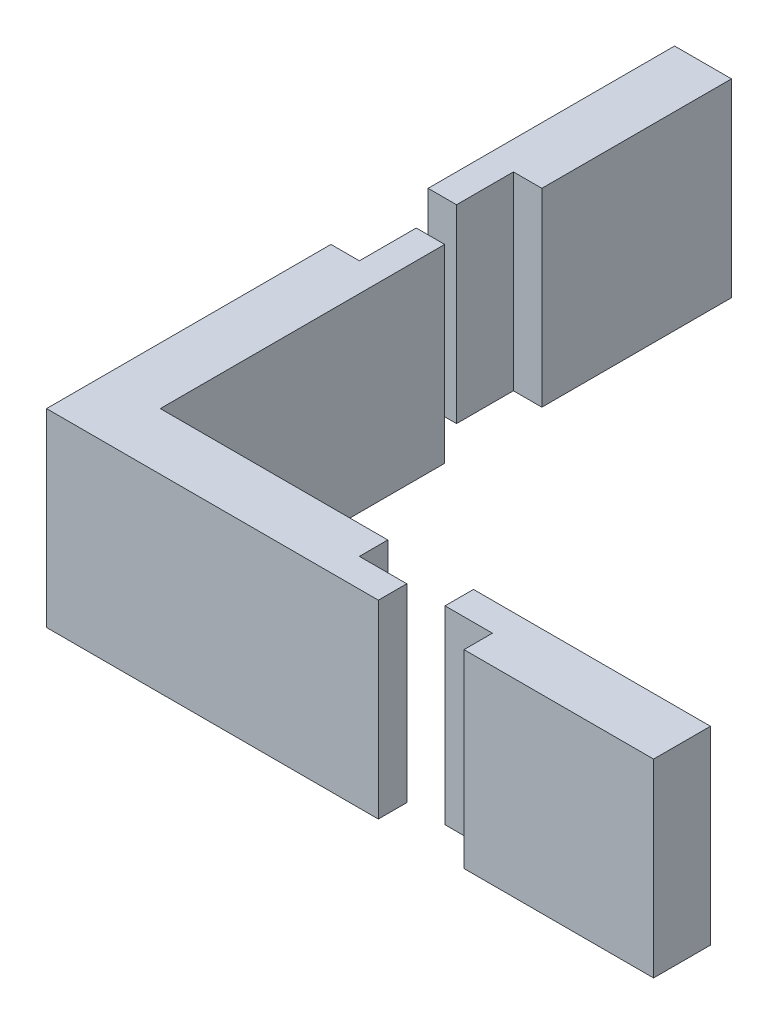
ISO-10303-21;
HEADER;
FILE_DESCRIPTION(('STEP AP214'),'2;1');
FILE_NAME('part.step','',(''),(''),'','','');
FILE_SCHEMA(('AUTOMOTIVE_DESIGN { 1 0 10303 214 1 1 1 1 }'));
ENDSEC;
DATA;
#1=APPLICATION_CONTEXT('core data for automotive mechanical design processes');
#2=APPLICATION_PROTOCOL_DEFINITION('international standard','automotive_design',2000,#1);
#3=PRODUCT_CONTEXT('',#1,'mechanical');
#4=PRODUCT('Part','Part','',(#3));
#5=PRODUCT_RELATED_PRODUCT_CATEGORY('part','',(#4));
#6=PRODUCT_DEFINITION_FORMATION('','',#4);
#7=PRODUCT_DEFINITION_CONTEXT('part definition',#1,'design');
#8=PRODUCT_DEFINITION('design','',#6,#7);
#9=PRODUCT_DEFINITION_SHAPE('','',#8);
#10=(LENGTH_UNIT() NAMED_UNIT(*) SI_UNIT(.MILLI.,.METRE.));
#11=(NAMED_UNIT(*) PLANE_ANGLE_UNIT() SI_UNIT($,.RADIAN.));
#12=(NAMED_UNIT(*) SI_UNIT($,.STERADIAN.) SOLID_ANGLE_UNIT());
#13=UNCERTAINTY_MEASURE_WITH_UNIT(LENGTH_MEASURE(1.E-05),#10,'distance_accuracy_value','');
#14=(GEOMETRIC_REPRESENTATION_CONTEXT(3) GLOBAL_UNCERTAINTY_ASSIGNED_CONTEXT((#13)) GLOBAL_UNIT_ASSIGNED_CONTEXT((#10,
#11,#12)) REPRESENTATION_CONTEXT('',''));
#15=CARTESIAN_POINT('',(0.,0.,0.));
#16=DIRECTION('',(0.,0.,1.));
#17=DIRECTION('',(1.,0.,0.));
#18=AXIS2_PLACEMENT_3D('',#15,#16,#17);
#19=CARTESIAN_POINT('',(0.,10.,-10.5));
#20=DIRECTION('',(0.,0.,1.));
#21=DIRECTION('',(1.,0.,0.));
#22=AXIS2_PLACEMENT_3D('',#19,#20,#21);
#23=PLANE('',#22);
#24=DIRECTION('',(-1.,0.,0.));
#25=VECTOR('',#24,1.);
#26=CARTESIAN_POINT('',(0.,0.,-10.5));
#27=LINE('',#26,#25);
#28=CARTESIAN_POINT('',(1.5,0.,-10.5));
#29=VERTEX_POINT('',#28);
#30=CARTESIAN_POINT('',(0.,0.,-10.5));
#31=VERTEX_POINT('',#30);
#32=EDGE_CURVE('E186',#29,#31,#27,.T.);
#33=ORIENTED_EDGE('',*,*,#32,.T.);
#34=DIRECTION('',(0.,-1.,0.));
#35=VECTOR('',#34,1.);
#36=CARTESIAN_POINT('',(0.,10.,-10.5));
#37=LINE('',#36,#35);
#38=CARTESIAN_POINT('',(0.,10.,-10.5));
#39=VERTEX_POINT('',#38);
#40=EDGE_CURVE('E205',#39,#31,#37,.T.);
#41=ORIENTED_EDGE('',*,*,#40,.F.);
#42=DIRECTION('',(-1.,0.,0.));
#43=VECTOR('',#42,1.);
#44=CARTESIAN_POINT('',(0.,10.,-10.5));
#45=LINE('',#44,#43);
#46=CARTESIAN_POINT('',(1.5,10.,-10.5));
#47=VERTEX_POINT('',#46);
#48=EDGE_CURVE('E183',#47,#39,#45,.T.);
#49=ORIENTED_EDGE('',*,*,#48,.F.);
#50=DIRECTION('',(0.,-1.,0.));
#51=VECTOR('',#50,1.);
#52=CARTESIAN_POINT('',(1.5,10.,-10.5));
#53=LINE('',#52,#51);
#54=EDGE_CURVE('E231',#47,#29,#53,.T.);
#55=ORIENTED_EDGE('',*,*,#54,.T.);
#56=EDGE_LOOP('',(#33,#41,#49,#55));
#57=FACE_BOUND('',#56,.T.);
#58=ADVANCED_FACE('F88',(#57),#23,.F.);
#59=CARTESIAN_POINT('',(1.5,10.,0.));
#60=DIRECTION('',(-1.,0.,0.));
#61=DIRECTION('',(0.,0.,1.));
#62=AXIS2_PLACEMENT_3D('',#59,#60,#61);
#63=PLANE('',#62);
#64=DIRECTION('',(0.,0.,-1.));
#65=VECTOR('',#64,1.);
#66=CARTESIAN_POINT('',(1.5,0.,0.));
#67=LINE('',#66,#65);
#68=CARTESIAN_POINT('',(1.5,0.,4.5));
#69=VERTEX_POINT('',#68);
#70=EDGE_CURVE('E223',#69,#29,#67,.T.);
#71=ORIENTED_EDGE('',*,*,#70,.T.);
#72=ORIENTED_EDGE('',*,*,#54,.F.);
#73=DIRECTION('',(0.,0.,-1.));
#74=VECTOR('',#73,1.);
#75=CARTESIAN_POINT('',(1.5,10.,0.));
#76=LINE('',#75,#74);
#77=CARTESIAN_POINT('',(1.5,10.,4.5));
#78=VERTEX_POINT('',#77);
#79=EDGE_CURVE('E200',#78,#47,#76,.T.);
#80=ORIENTED_EDGE('',*,*,#79,.F.);
#81=DIRECTION('',(0.,-1.,0.));
#82=VECTOR('',#81,1.);
#83=CARTESIAN_POINT('',(1.5,10.,4.5));
#84=LINE('',#83,#82);
#85=EDGE_CURVE('E235',#78,#69,#84,.T.);
#86=ORIENTED_EDGE('',*,*,#85,.T.);
#87=EDGE_LOOP('',(#71,#72,#80,#86));
#88=FACE_BOUND('',#87,.T.);
#89=ADVANCED_FACE('F298',(#88),#63,.F.);
#90=CARTESIAN_POINT('',(0.,10.,-7.5));
#91=DIRECTION('',(0.,0.,-1.));
#92=DIRECTION('',(-1.,0.,0.));
#93=AXIS2_PLACEMENT_3D('',#90,#91,#92);
#94=PLANE('',#93);
#95=DIRECTION('',(1.,0.,0.));
#96=VECTOR('',#95,1.);
#97=CARTESIAN_POINT('',(0.,0.,-7.5));
#98=LINE('',#97,#96);
#99=CARTESIAN_POINT('',(-1.5,0.,-7.5));
#100=VERTEX_POINT('',#99);
#101=CARTESIAN_POINT('',(0.,0.,-7.5));
#102=VERTEX_POINT('',#101);
#103=EDGE_CURVE('E209',#100,#102,#98,.T.);
#104=ORIENTED_EDGE('',*,*,#103,.F.);
#105=DIRECTION('',(0.,-1.,0.));
#106=VECTOR('',#105,1.);
#107=CARTESIAN_POINT('',(-1.5,10.,-7.5));
#108=LINE('',#107,#106);
#109=CARTESIAN_POINT('',(-1.5,10.,-7.5));
#110=VERTEX_POINT('',#109);
#111=EDGE_CURVE('E163',#110,#100,#108,.T.);
#112=ORIENTED_EDGE('',*,*,#111,.F.);
#113=DIRECTION('',(1.,0.,0.));
#114=VECTOR('',#113,1.);
#115=CARTESIAN_POINT('',(0.,10.,-7.5));
#116=LINE('',#115,#114);
#117=CARTESIAN_POINT('',(0.,10.,-7.5));
#118=VERTEX_POINT('',#117);
#119=EDGE_CURVE('E181',#110,#118,#116,.T.);
#120=ORIENTED_EDGE('',*,*,#119,.T.);
#121=DIRECTION('',(0.,-1.,0.));
#122=VECTOR('',#121,1.);
#123=CARTESIAN_POINT('',(0.,10.,-7.5));
#124=LINE('',#123,#122);
#125=EDGE_CURVE('E169',#118,#102,#124,.T.);
#126=ORIENTED_EDGE('',*,*,#125,.T.);
#127=EDGE_LOOP('',(#104,#112,#120,#126));
#128=FACE_BOUND('',#127,.T.);
#129=ADVANCED_FACE('F187',(#128),#94,.T.);
#130=CARTESIAN_POINT('',(0.,10.,0.));
#131=DIRECTION('',(-1.,0.,0.));
#132=DIRECTION('',(0.,0.,1.));
#133=AXIS2_PLACEMENT_3D('',#130,#131,#132);
#134=PLANE('',#133);
#135=DIRECTION('',(0.,0.,-1.));
#136=VECTOR('',#135,1.);
#137=CARTESIAN_POINT('',(0.,0.,0.));
#138=LINE('',#137,#136);
#139=EDGE_CURVE('E173',#102,#31,#138,.T.);
#140=ORIENTED_EDGE('',*,*,#139,.F.);
#141=ORIENTED_EDGE('',*,*,#125,.F.);
#142=DIRECTION('',(0.,0.,-1.));
#143=VECTOR('',#142,1.);
#144=CARTESIAN_POINT('',(0.,10.,0.));
#145=LINE('',#144,#143);
#146=EDGE_CURVE('E92',#118,#39,#145,.T.);
#147=ORIENTED_EDGE('',*,*,#146,.T.);
#148=ORIENTED_EDGE('',*,*,#40,.T.);
#149=EDGE_LOOP('',(#140,#141,#147,#148));
#150=FACE_BOUND('',#149,.T.);
#151=ADVANCED_FACE('F171',(#150),#134,.T.);
#152=CARTESIAN_POINT('',(-1.5,10.,0.));
#153=DIRECTION('',(1.,0.,0.));
#154=DIRECTION('',(0.,0.,-1.));
#155=AXIS2_PLACEMENT_3D('',#152,#153,#154);
#156=PLANE('',#155);
#157=DIRECTION('',(0.,0.,1.));
#158=VECTOR('',#157,1.);
#159=CARTESIAN_POINT('',(-1.5,0.,0.));
#160=LINE('',#159,#158);
#161=CARTESIAN_POINT('',(-1.5,0.,7.5));
#162=VERTEX_POINT('',#161);
#163=EDGE_CURVE('E212',#100,#162,#160,.T.);
#164=ORIENTED_EDGE('',*,*,#163,.T.);
#165=DIRECTION('',(0.,-1.,0.));
#166=VECTOR('',#165,1.);
#167=CARTESIAN_POINT('',(-1.5,10.,7.5));
#168=LINE('',#167,#166);
#169=CARTESIAN_POINT('',(-1.5,10.,7.5));
#170=VERTEX_POINT('',#169);
#171=EDGE_CURVE('E242',#170,#162,#168,.T.);
#172=ORIENTED_EDGE('',*,*,#171,.F.);
#173=DIRECTION('',(0.,0.,1.));
#174=VECTOR('',#173,1.);
#175=CARTESIAN_POINT('',(-1.5,10.,0.));
#176=LINE('',#175,#174);
#177=EDGE_CURVE('E189',#110,#170,#176,.T.);
#178=ORIENTED_EDGE('',*,*,#177,.F.);
#179=ORIENTED_EDGE('',*,*,#111,.T.);
#180=EDGE_LOOP('',(#164,#172,#178,#179));
#181=FACE_BOUND('',#180,.T.);
#182=ADVANCED_FACE('F280',(#181),#156,.F.);
#183=CARTESIAN_POINT('',(0.,10.,4.5));
#184=DIRECTION('',(0.,0.,-1.));
#185=DIRECTION('',(-1.,0.,0.));
#186=AXIS2_PLACEMENT_3D('',#183,#184,#185);
#187=PLANE('',#186);
#188=DIRECTION('',(1.,0.,0.));
#189=VECTOR('',#188,1.);
#190=CARTESIAN_POINT('',(0.,0.,4.5));
#191=LINE('',#190,#189);
#192=CARTESIAN_POINT('',(13.5,0.,4.5));
#193=VERTEX_POINT('',#192);
#194=EDGE_CURVE('E219',#69,#193,#191,.T.);
#195=ORIENTED_EDGE('',*,*,#194,.F.);
#196=ORIENTED_EDGE('',*,*,#85,.F.);
#197=DIRECTION('',(1.,0.,0.));
#198=VECTOR('',#197,1.);
#199=CARTESIAN_POINT('',(0.,10.,4.5));
#200=LINE('',#199,#198);
#201=CARTESIAN_POINT('',(13.5,10.,4.5));
#202=VERTEX_POINT('',#201);
#203=EDGE_CURVE('E196',#78,#202,#200,.T.);
#204=ORIENTED_EDGE('',*,*,#203,.T.);
#205=DIRECTION('',(0.,-1.,0.));
#206=VECTOR('',#205,1.);
#207=CARTESIAN_POINT('',(13.5,10.,4.5));
#208=LINE('',#207,#206);
#209=EDGE_CURVE('E238',#202,#193,#208,.T.);
#210=ORIENTED_EDGE('',*,*,#209,.T.);
#211=EDGE_LOOP('',(#195,#196,#204,#210));
#212=FACE_BOUND('',#211,.T.);
#213=ADVANCED_FACE('F295',(#212),#187,.T.);
#214=CARTESIAN_POINT('',(0.,0.,0.));
#215=DIRECTION('',(0.,1.,0.));
#216=DIRECTION('',(0.,0.,1.));
#217=AXIS2_PLACEMENT_3D('',#214,#215,#216);
#218=PLANE('',#217);
#219=ORIENTED_EDGE('',*,*,#139,.T.);
#220=ORIENTED_EDGE('',*,*,#32,.F.);
#221=ORIENTED_EDGE('',*,*,#70,.F.);
#222=ORIENTED_EDGE('',*,*,#194,.T.);
#223=DIRECTION('',(0.,0.,-1.));
#224=VECTOR('',#223,1.);
#225=CARTESIAN_POINT('',(13.5,0.,0.));
#226=LINE('',#225,#224);
#227=CARTESIAN_POINT('',(13.5,0.,5.99999999999999));
#228=VERTEX_POINT('',#227);
#229=EDGE_CURVE('E216',#228,#193,#226,.T.);
#230=ORIENTED_EDGE('',*,*,#229,.F.);
#231=DIRECTION('',(1.,0.,0.));
#232=VECTOR('',#231,1.);
#233=CARTESIAN_POINT('',(13.5,0.,5.99999999999999));
#234=LINE('',#233,#232);
#235=CARTESIAN_POINT('',(16.,0.,5.99999999999999));
#236=VERTEX_POINT('',#235);
#237=EDGE_CURVE('E252',#228,#236,#234,.T.);
#238=ORIENTED_EDGE('',*,*,#237,.T.);
#239=DIRECTION('',(0.,0.,-1.));
#240=VECTOR('',#239,1.);
#241=CARTESIAN_POINT('',(16.,0.,7.5));
#242=LINE('',#241,#240);
#243=CARTESIAN_POINT('',(16.,0.,7.5));
#244=VERTEX_POINT('',#243);
#245=EDGE_CURVE('E99',#244,#236,#242,.T.);
#246=ORIENTED_EDGE('',*,*,#245,.F.);
#247=DIRECTION('',(1.,0.,0.));
#248=VECTOR('',#247,1.);
#249=CARTESIAN_POINT('',(13.5,0.,7.5));
#250=LINE('',#249,#248);
#251=EDGE_CURVE('E13',#162,#244,#250,.T.);
#252=ORIENTED_EDGE('',*,*,#251,.F.);
#253=ORIENTED_EDGE('',*,*,#163,.F.);
#254=ORIENTED_EDGE('',*,*,#103,.T.);
#255=EDGE_LOOP('',(#219,#220,#221,#222,#230,#238,#246,#252,#253,#254));
#256=FACE_BOUND('',#255,.T.);
#257=ADVANCED_FACE('F278',(#256),#218,.F.);
#258=CARTESIAN_POINT('',(0.,10.,0.));
#259=DIRECTION('',(0.,1.,0.));
#260=DIRECTION('',(0.,0.,1.));
#261=AXIS2_PLACEMENT_3D('',#258,#259,#260);
#262=PLANE('',#261);
#263=ORIENTED_EDGE('',*,*,#146,.F.);
#264=ORIENTED_EDGE('',*,*,#119,.F.);
#265=ORIENTED_EDGE('',*,*,#177,.T.);
#266=DIRECTION('',(1.,0.,0.));
#267=VECTOR('',#266,1.);
#268=CARTESIAN_POINT('',(13.5,10.,7.5));
#269=LINE('',#268,#267);
#270=CARTESIAN_POINT('',(16.,10.,7.5));
#271=VERTEX_POINT('',#270);
#272=EDGE_CURVE('E248',#170,#271,#269,.T.);
#273=ORIENTED_EDGE('',*,*,#272,.T.);
#274=DIRECTION('',(0.,0.,-1.));
#275=VECTOR('',#274,1.);
#276=CARTESIAN_POINT('',(16.,10.,7.5));
#277=LINE('',#276,#275);
#278=CARTESIAN_POINT('',(16.,10.,5.99999999999999));
#279=VERTEX_POINT('',#278);
#280=EDGE_CURVE('E253',#271,#279,#277,.T.);
#281=ORIENTED_EDGE('',*,*,#280,.T.);
#282=DIRECTION('',(1.,0.,0.));
#283=VECTOR('',#282,1.);
#284=CARTESIAN_POINT('',(13.5,10.,5.99999999999999));
#285=LINE('',#284,#283);
#286=CARTESIAN_POINT('',(13.5,10.,5.99999999999999));
#287=VERTEX_POINT('',#286);
#288=EDGE_CURVE('E256',#287,#279,#285,.T.);
#289=ORIENTED_EDGE('',*,*,#288,.F.);
#290=DIRECTION('',(0.,0.,-1.));
#291=VECTOR('',#290,1.);
#292=CARTESIAN_POINT('',(13.5,10.,0.));
#293=LINE('',#292,#291);
#294=EDGE_CURVE('E191',#287,#202,#293,.T.);
#295=ORIENTED_EDGE('',*,*,#294,.T.);
#296=ORIENTED_EDGE('',*,*,#203,.F.);
#297=ORIENTED_EDGE('',*,*,#79,.T.);
#298=ORIENTED_EDGE('',*,*,#48,.T.);
#299=EDGE_LOOP('',(#263,#264,#265,#273,#281,#289,#295,#296,#297,#298));
#300=FACE_BOUND('',#299,.T.);
#301=ADVANCED_FACE('F90',(#300),#262,.T.);
#302=CARTESIAN_POINT('',(13.5,10.,0.));
#303=DIRECTION('',(-1.,0.,0.));
#304=DIRECTION('',(0.,0.,1.));
#305=AXIS2_PLACEMENT_3D('',#302,#303,#304);
#306=PLANE('',#305);
#307=ORIENTED_EDGE('',*,*,#294,.F.);
#308=DIRECTION('',(0.,-1.,0.));
#309=VECTOR('',#308,1.);
#310=CARTESIAN_POINT('',(13.5,10.,5.99999999999999));
#311=LINE('',#310,#309);
#312=EDGE_CURVE('E176',#287,#228,#311,.T.);
#313=ORIENTED_EDGE('',*,*,#312,.T.);
#314=ORIENTED_EDGE('',*,*,#229,.T.);
#315=ORIENTED_EDGE('',*,*,#209,.F.);
#316=EDGE_LOOP('',(#307,#313,#314,#315));
#317=FACE_BOUND('',#316,.T.);
#318=ADVANCED_FACE('F288',(#317),#306,.F.);
#319=CARTESIAN_POINT('',(0.,10.,7.5));
#320=DIRECTION('',(0.,0.,-1.));
#321=DIRECTION('',(-1.,0.,0.));
#322=AXIS2_PLACEMENT_3D('',#319,#320,#321);
#323=PLANE('',#322);
#324=ORIENTED_EDGE('',*,*,#171,.T.);
#325=ORIENTED_EDGE('',*,*,#251,.T.);
#326=DIRECTION('',(0.,-1.,0.));
#327=VECTOR('',#326,1.);
#328=CARTESIAN_POINT('',(16.,10.,7.5));
#329=LINE('',#328,#327);
#330=EDGE_CURVE('E208',#271,#244,#329,.T.);
#331=ORIENTED_EDGE('',*,*,#330,.F.);
#332=ORIENTED_EDGE('',*,*,#272,.F.);
#333=EDGE_LOOP('',(#324,#325,#331,#332));
#334=FACE_BOUND('',#333,.T.);
#335=ADVANCED_FACE('F275',(#334),#323,.F.);
#336=CARTESIAN_POINT('',(16.,10.,7.5));
#337=DIRECTION('',(-1.,0.,0.));
#338=DIRECTION('',(0.,0.,1.));
#339=AXIS2_PLACEMENT_3D('',#336,#337,#338);
#340=PLANE('',#339);
#341=ORIENTED_EDGE('',*,*,#245,.T.);
#342=DIRECTION('',(0.,-1.,0.));
#343=VECTOR('',#342,1.);
#344=CARTESIAN_POINT('',(16.,10.,5.99999999999999));
#345=LINE('',#344,#343);
#346=EDGE_CURVE('E259',#279,#236,#345,.T.);
#347=ORIENTED_EDGE('',*,*,#346,.F.);
#348=ORIENTED_EDGE('',*,*,#280,.F.);
#349=ORIENTED_EDGE('',*,*,#330,.T.);
#350=EDGE_LOOP('',(#341,#347,#348,#349));
#351=FACE_BOUND('',#350,.T.);
#352=ADVANCED_FACE('F272',(#351),#340,.F.);
#353=CARTESIAN_POINT('',(13.5,10.,5.99999999999999));
#354=DIRECTION('',(0.,0.,-1.));
#355=DIRECTION('',(-1.,0.,0.));
#356=AXIS2_PLACEMENT_3D('',#353,#354,#355);
#357=PLANE('',#356);
#358=ORIENTED_EDGE('',*,*,#237,.F.);
#359=ORIENTED_EDGE('',*,*,#312,.F.);
#360=ORIENTED_EDGE('',*,*,#288,.T.);
#361=ORIENTED_EDGE('',*,*,#346,.T.);
#362=EDGE_LOOP('',(#358,#359,#360,#361));
#363=FACE_BOUND('',#362,.T.);
#364=ADVANCED_FACE('F285',(#363),#357,.T.);
#365=CLOSED_SHELL('',(#58,#89,#129,#151,#182,#213,#257,#301,#318,#335,#352,#364));
#366=MANIFOLD_SOLID_BREP('B2',#365);
#367=CARTESIAN_POINT('',(18.0177509488998,10.,0.));
#368=DIRECTION('',(-1.,0.,0.));
#369=DIRECTION('',(0.,0.,1.));
#370=AXIS2_PLACEMENT_3D('',#367,#368,#369);
#371=PLANE('',#370);
#372=DIRECTION('',(0.,0.,-1.));
#373=VECTOR('',#372,1.);
#374=CARTESIAN_POINT('',(18.0177509488998,0.,0.));
#375=LINE('',#374,#373);
#376=CARTESIAN_POINT('',(18.0177509488998,0.,5.99999999999999));
#377=VERTEX_POINT('',#376);
#378=CARTESIAN_POINT('',(18.0177509488998,0.,4.5));
#379=VERTEX_POINT('',#378);
#380=EDGE_CURVE('E86',#377,#379,#375,.T.);
#381=ORIENTED_EDGE('',*,*,#380,.F.);
#382=DIRECTION('',(0.,-1.,0.));
#383=VECTOR('',#382,1.);
#384=CARTESIAN_POINT('',(18.0177509488998,10.,5.99999999999999));
#385=LINE('',#384,#383);
#386=CARTESIAN_POINT('',(18.0177509488998,10.,5.99999999999999));
#387=VERTEX_POINT('',#386);
#388=EDGE_CURVE('E456',#387,#377,#385,.T.);
#389=ORIENTED_EDGE('',*,*,#388,.F.);
#390=DIRECTION('',(0.,0.,-1.));
#391=VECTOR('',#390,1.);
#392=CARTESIAN_POINT('',(18.0177509488998,10.,0.));
#393=LINE('',#392,#391);
#394=CARTESIAN_POINT('',(18.0177509488998,10.,4.5));
#395=VERTEX_POINT('',#394);
#396=EDGE_CURVE('E441',#387,#395,#393,.T.);
#397=ORIENTED_EDGE('',*,*,#396,.T.);
#398=DIRECTION('',(0.,-1.,0.));
#399=VECTOR('',#398,1.);
#400=CARTESIAN_POINT('',(18.0177509488998,10.,4.5));
#401=LINE('',#400,#399);
#402=EDGE_CURVE('E486',#395,#379,#401,.T.);
#403=ORIENTED_EDGE('',*,*,#402,.T.);
#404=EDGE_LOOP('',(#381,#389,#397,#403));
#405=FACE_BOUND('',#404,.T.);
#406=ADVANCED_FACE('F437',(#405),#371,.T.);
#407=CARTESIAN_POINT('',(0.,10.,5.99999999999999));
#408=DIRECTION('',(0.,0.,1.));
#409=DIRECTION('',(1.,0.,0.));
#410=AXIS2_PLACEMENT_3D('',#407,#408,#409);
#411=PLANE('',#410);
#412=DIRECTION('',(-1.,0.,0.));
#413=VECTOR('',#412,1.);
#414=CARTESIAN_POINT('',(0.,0.,5.99999999999999));
#415=LINE('',#414,#413);
#416=CARTESIAN_POINT('',(20.5177509488998,0.,5.99999999999999));
#417=VERTEX_POINT('',#416);
#418=EDGE_CURVE('E447',#417,#377,#415,.T.);
#419=ORIENTED_EDGE('',*,*,#418,.F.);
#420=DIRECTION('',(0.,-1.,0.));
#421=VECTOR('',#420,1.);
#422=CARTESIAN_POINT('',(20.5177509488998,10.,5.99999999999999));
#423=LINE('',#422,#421);
#424=CARTESIAN_POINT('',(20.5177509488998,10.,5.99999999999999));
#425=VERTEX_POINT('',#424);
#426=EDGE_CURVE('E476',#425,#417,#423,.T.);
#427=ORIENTED_EDGE('',*,*,#426,.F.);
#428=DIRECTION('',(-1.,0.,0.));
#429=VECTOR('',#428,1.);
#430=CARTESIAN_POINT('',(0.,10.,5.99999999999999));
#431=LINE('',#430,#429);
#432=EDGE_CURVE('E531',#425,#387,#431,.T.);
#433=ORIENTED_EDGE('',*,*,#432,.T.);
#434=ORIENTED_EDGE('',*,*,#388,.T.);
#435=EDGE_LOOP('',(#419,#427,#433,#434));
#436=FACE_BOUND('',#435,.T.);
#437=ADVANCED_FACE('F555',(#436),#411,.T.);
#438=CARTESIAN_POINT('',(20.5177509488998,10.,0.));
#439=DIRECTION('',(-1.,0.,0.));
#440=DIRECTION('',(0.,0.,1.));
#441=AXIS2_PLACEMENT_3D('',#438,#439,#440);
#442=PLANE('',#441);
#443=DIRECTION('',(0.,0.,-1.));
#444=VECTOR('',#443,1.);
#445=CARTESIAN_POINT('',(20.5177509488998,0.,0.));
#446=LINE('',#445,#444);
#447=CARTESIAN_POINT('',(20.5177509488998,0.,7.5));
#448=VERTEX_POINT('',#447);
#449=EDGE_CURVE('E514',#448,#417,#446,.T.);
#450=ORIENTED_EDGE('',*,*,#449,.F.);
#451=DIRECTION('',(0.,-1.,0.));
#452=VECTOR('',#451,1.);
#453=CARTESIAN_POINT('',(20.5177509488998,10.,7.5));
#454=LINE('',#453,#452);
#455=CARTESIAN_POINT('',(20.5177509488998,10.,7.5));
#456=VERTEX_POINT('',#455);
#457=EDGE_CURVE('E497',#456,#448,#454,.T.);
#458=ORIENTED_EDGE('',*,*,#457,.F.);
#459=DIRECTION('',(0.,0.,-1.));
#460=VECTOR('',#459,1.);
#461=CARTESIAN_POINT('',(20.5177509488998,10.,0.));
#462=LINE('',#461,#460);
#463=EDGE_CURVE('E530',#456,#425,#462,.T.);
#464=ORIENTED_EDGE('',*,*,#463,.T.);
#465=ORIENTED_EDGE('',*,*,#426,.T.);
#466=EDGE_LOOP('',(#450,#458,#464,#465));
#467=FACE_BOUND('',#466,.T.);
#468=ADVANCED_FACE('F519',(#467),#442,.T.);
#469=CARTESIAN_POINT('',(0.,10.,7.49999999999999));
#470=DIRECTION('',(0.,0.,-1.));
#471=DIRECTION('',(-1.,0.,0.));
#472=AXIS2_PLACEMENT_3D('',#469,#470,#471);
#473=PLANE('',#472);
#474=DIRECTION('',(1.,0.,0.));
#475=VECTOR('',#474,1.);
#476=CARTESIAN_POINT('',(0.,0.,7.49999999999999));
#477=LINE('',#476,#475);
#478=CARTESIAN_POINT('',(30.5177509488998,0.,7.5));
#479=VERTEX_POINT('',#478);
#480=EDGE_CURVE('E501',#448,#479,#477,.T.);
#481=ORIENTED_EDGE('',*,*,#480,.T.);
#482=DIRECTION('',(0.,-1.,0.));
#483=VECTOR('',#482,1.);
#484=CARTESIAN_POINT('',(30.5177509488998,10.,7.5));
#485=LINE('',#484,#483);
#486=CARTESIAN_POINT('',(30.5177509488998,10.,7.5));
#487=VERTEX_POINT('',#486);
#488=EDGE_CURVE('E508',#487,#479,#485,.T.);
#489=ORIENTED_EDGE('',*,*,#488,.F.);
#490=DIRECTION('',(1.,0.,0.));
#491=VECTOR('',#490,1.);
#492=CARTESIAN_POINT('',(0.,10.,7.49999999999999));
#493=LINE('',#492,#491);
#494=EDGE_CURVE('E503',#456,#487,#493,.T.);
#495=ORIENTED_EDGE('',*,*,#494,.F.);
#496=ORIENTED_EDGE('',*,*,#457,.T.);
#497=EDGE_LOOP('',(#481,#489,#495,#496));
#498=FACE_BOUND('',#497,.T.);
#499=ADVANCED_FACE('F499',(#498),#473,.F.);
#500=CARTESIAN_POINT('',(30.5177509488998,10.,0.));
#501=DIRECTION('',(1.,0.,0.));
#502=DIRECTION('',(0.,0.,-1.));
#503=AXIS2_PLACEMENT_3D('',#500,#501,#502);
#504=PLANE('',#503);
#505=DIRECTION('',(0.,0.,1.));
#506=VECTOR('',#505,1.);
#507=CARTESIAN_POINT('',(30.5177509488998,0.,0.));
#508=LINE('',#507,#506);
#509=CARTESIAN_POINT('',(30.5177509488998,0.,4.5));
#510=VERTEX_POINT('',#509);
#511=EDGE_CURVE('E517',#510,#479,#508,.T.);
#512=ORIENTED_EDGE('',*,*,#511,.F.);
#513=DIRECTION('',(0.,-1.,0.));
#514=VECTOR('',#513,1.);
#515=CARTESIAN_POINT('',(30.5177509488998,10.,4.5));
#516=LINE('',#515,#514);
#517=CARTESIAN_POINT('',(30.5177509488998,10.,4.5));
#518=VERTEX_POINT('',#517);
#519=EDGE_CURVE('E537',#518,#510,#516,.T.);
#520=ORIENTED_EDGE('',*,*,#519,.F.);
#521=DIRECTION('',(0.,0.,1.));
#522=VECTOR('',#521,1.);
#523=CARTESIAN_POINT('',(30.5177509488998,10.,0.));
#524=LINE('',#523,#522);
#525=EDGE_CURVE('E526',#518,#487,#524,.T.);
#526=ORIENTED_EDGE('',*,*,#525,.T.);
#527=ORIENTED_EDGE('',*,*,#488,.T.);
#528=EDGE_LOOP('',(#512,#520,#526,#527));
#529=FACE_BOUND('',#528,.T.);
#530=ADVANCED_FACE('F542',(#529),#504,.T.);
#531=CARTESIAN_POINT('',(0.,10.,4.5));
#532=DIRECTION('',(0.,0.,1.));
#533=DIRECTION('',(1.,0.,0.));
#534=AXIS2_PLACEMENT_3D('',#531,#532,#533);
#535=PLANE('',#534);
#536=DIRECTION('',(-1.,0.,0.));
#537=VECTOR('',#536,1.);
#538=CARTESIAN_POINT('',(0.,0.,4.5));
#539=LINE('',#538,#537);
#540=EDGE_CURVE('E532',#510,#379,#539,.T.);
#541=ORIENTED_EDGE('',*,*,#540,.T.);
#542=ORIENTED_EDGE('',*,*,#402,.F.);
#543=DIRECTION('',(-1.,0.,0.));
#544=VECTOR('',#543,1.);
#545=CARTESIAN_POINT('',(0.,10.,4.5));
#546=LINE('',#545,#544);
#547=EDGE_CURVE('E524',#518,#395,#546,.T.);
#548=ORIENTED_EDGE('',*,*,#547,.F.);
#549=ORIENTED_EDGE('',*,*,#519,.T.);
#550=EDGE_LOOP('',(#541,#542,#548,#549));
#551=FACE_BOUND('',#550,.T.);
#552=ADVANCED_FACE('F546',(#551),#535,.F.);
#553=CARTESIAN_POINT('',(0.,10.,0.));
#554=DIRECTION('',(0.,1.,0.));
#555=DIRECTION('',(0.,0.,1.));
#556=AXIS2_PLACEMENT_3D('',#553,#554,#555);
#557=PLANE('',#556);
#558=ORIENTED_EDGE('',*,*,#396,.F.);
#559=ORIENTED_EDGE('',*,*,#432,.F.);
#560=ORIENTED_EDGE('',*,*,#463,.F.);
#561=ORIENTED_EDGE('',*,*,#494,.T.);
#562=ORIENTED_EDGE('',*,*,#525,.F.);
#563=ORIENTED_EDGE('',*,*,#547,.T.);
#564=EDGE_LOOP('',(#558,#559,#560,#561,#562,#563));
#565=FACE_BOUND('',#564,.T.);
#566=ADVANCED_FACE('F439',(#565),#557,.T.);
#567=CARTESIAN_POINT('',(0.,0.,0.));
#568=DIRECTION('',(0.,1.,0.));
#569=DIRECTION('',(0.,0.,1.));
#570=AXIS2_PLACEMENT_3D('',#567,#568,#569);
#571=PLANE('',#570);
#572=ORIENTED_EDGE('',*,*,#380,.T.);
#573=ORIENTED_EDGE('',*,*,#540,.F.);
#574=ORIENTED_EDGE('',*,*,#511,.T.);
#575=ORIENTED_EDGE('',*,*,#480,.F.);
#576=ORIENTED_EDGE('',*,*,#449,.T.);
#577=ORIENTED_EDGE('',*,*,#418,.T.);
#578=EDGE_LOOP('',(#572,#573,#574,#575,#576,#577));
#579=FACE_BOUND('',#578,.T.);
#580=ADVANCED_FACE('F512',(#579),#571,.F.);
#581=CLOSED_SHELL('',(#406,#437,#468,#499,#530,#552,#566,#580));
#582=MANIFOLD_SOLID_BREP('B7',#581);
#583=CARTESIAN_POINT('',(0.,10.,-15.6250860957635));
#584=DIRECTION('',(0.,0.,-1.));
#585=DIRECTION('',(-1.,0.,0.));
#586=AXIS2_PLACEMENT_3D('',#583,#584,#585);
#587=PLANE('',#586);
#588=DIRECTION('',(1.,0.,0.));
#589=VECTOR('',#588,1.);
#590=CARTESIAN_POINT('',(0.,0.,-15.6250860957635));
#591=LINE('',#590,#589);
#592=CARTESIAN_POINT('',(0.,0.,-15.6250860957635));
#593=VERTEX_POINT('',#592);
#594=CARTESIAN_POINT('',(1.5,0.,-15.6250860957635));
#595=VERTEX_POINT('',#594);
#596=EDGE_CURVE('E707',#593,#595,#591,.T.);
#597=ORIENTED_EDGE('',*,*,#596,.T.);
#598=DIRECTION('',(0.,-1.,0.));
#599=VECTOR('',#598,1.);
#600=CARTESIAN_POINT('',(1.5,10.,-15.6250860957635));
#601=LINE('',#600,#599);
#602=CARTESIAN_POINT('',(1.5,10.,-15.6250860957635));
#603=VERTEX_POINT('',#602);
#604=EDGE_CURVE('E435',#603,#595,#601,.T.);
#605=ORIENTED_EDGE('',*,*,#604,.F.);
#606=DIRECTION('',(1.,0.,0.));
#607=VECTOR('',#606,1.);
#608=CARTESIAN_POINT('',(0.,10.,-15.6250860957635));
#609=LINE('',#608,#607);
#610=CARTESIAN_POINT('',(0.,10.,-15.6250860957635));
#611=VERTEX_POINT('',#610);
#612=EDGE_CURVE('E720',#611,#603,#609,.T.);
#613=ORIENTED_EDGE('',*,*,#612,.F.);
#614=DIRECTION('',(0.,-1.,0.));
#615=VECTOR('',#614,1.);
#616=CARTESIAN_POINT('',(0.,10.,-15.6250860957635));
#617=LINE('',#616,#615);
#618=EDGE_CURVE('E703',#611,#593,#617,.T.);
#619=ORIENTED_EDGE('',*,*,#618,.T.);
#620=EDGE_LOOP('',(#597,#605,#613,#619));
#621=FACE_BOUND('',#620,.T.);
#622=ADVANCED_FACE('F625',(#621),#587,.F.);
#623=CARTESIAN_POINT('',(1.5,10.,0.));
#624=DIRECTION('',(-1.,0.,0.));
#625=DIRECTION('',(0.,0.,1.));
#626=AXIS2_PLACEMENT_3D('',#623,#624,#625);
#627=PLANE('',#626);
#628=DIRECTION('',(0.,0.,-1.));
#629=VECTOR('',#628,1.);
#630=CARTESIAN_POINT('',(1.5,0.,0.));
#631=LINE('',#630,#629);
#632=CARTESIAN_POINT('',(1.5,0.,-25.6250860957635));
#633=VERTEX_POINT('',#632);
#634=EDGE_CURVE('E710',#595,#633,#631,.T.);
#635=ORIENTED_EDGE('',*,*,#634,.T.);
#636=DIRECTION('',(0.,-1.,0.));
#637=VECTOR('',#636,1.);
#638=CARTESIAN_POINT('',(1.5,10.,-25.6250860957635));
#639=LINE('',#638,#637);
#640=CARTESIAN_POINT('',(1.5,10.,-25.6250860957635));
#641=VERTEX_POINT('',#640);
#642=EDGE_CURVE('E633',#641,#633,#639,.T.);
#643=ORIENTED_EDGE('',*,*,#642,.F.);
#644=DIRECTION('',(0.,0.,-1.));
#645=VECTOR('',#644,1.);
#646=CARTESIAN_POINT('',(1.5,10.,0.));
#647=LINE('',#646,#645);
#648=EDGE_CURVE('E674',#603,#641,#647,.T.);
#649=ORIENTED_EDGE('',*,*,#648,.F.);
#650=ORIENTED_EDGE('',*,*,#604,.T.);
#651=EDGE_LOOP('',(#635,#643,#649,#650));
#652=FACE_BOUND('',#651,.T.);
#653=ADVANCED_FACE('F726',(#652),#627,.F.);
#654=CARTESIAN_POINT('',(0.,10.,-25.6250860957635));
#655=DIRECTION('',(0.,0.,-1.));
#656=DIRECTION('',(-1.,0.,0.));
#657=AXIS2_PLACEMENT_3D('',#654,#655,#656);
#658=PLANE('',#657);
#659=DIRECTION('',(1.,0.,0.));
#660=VECTOR('',#659,1.);
#661=CARTESIAN_POINT('',(0.,0.,-25.6250860957635));
#662=LINE('',#661,#660);
#663=CARTESIAN_POINT('',(-1.5,0.,-25.6250860957635));
#664=VERTEX_POINT('',#663);
#665=EDGE_CURVE('E713',#664,#633,#662,.T.);
#666=ORIENTED_EDGE('',*,*,#665,.F.);
#667=DIRECTION('',(0.,-1.,0.));
#668=VECTOR('',#667,1.);
#669=CARTESIAN_POINT('',(-1.5,10.,-25.6250860957635));
#670=LINE('',#669,#668);
#671=CARTESIAN_POINT('',(-1.5,10.,-25.6250860957635));
#672=VERTEX_POINT('',#671);
#673=EDGE_CURVE('E693',#672,#664,#670,.T.);
#674=ORIENTED_EDGE('',*,*,#673,.F.);
#675=DIRECTION('',(1.,0.,0.));
#676=VECTOR('',#675,1.);
#677=CARTESIAN_POINT('',(0.,10.,-25.6250860957635));
#678=LINE('',#677,#676);
#679=EDGE_CURVE('E699',#672,#641,#678,.T.);
#680=ORIENTED_EDGE('',*,*,#679,.T.);
#681=ORIENTED_EDGE('',*,*,#642,.T.);
#682=EDGE_LOOP('',(#666,#674,#680,#681));
#683=FACE_BOUND('',#682,.T.);
#684=ADVANCED_FACE('F725',(#683),#658,.T.);
#685=CARTESIAN_POINT('',(-1.5,10.,0.));
#686=DIRECTION('',(-1.,0.,0.));
#687=DIRECTION('',(0.,0.,1.));
#688=AXIS2_PLACEMENT_3D('',#685,#686,#687);
#689=PLANE('',#688);
#690=DIRECTION('',(0.,0.,-1.));
#691=VECTOR('',#690,1.);
#692=CARTESIAN_POINT('',(-1.5,0.,0.));
#693=LINE('',#692,#691);
#694=CARTESIAN_POINT('',(-1.5,0.,-12.6250860957635));
#695=VERTEX_POINT('',#694);
#696=EDGE_CURVE('E688',#695,#664,#693,.T.);
#697=ORIENTED_EDGE('',*,*,#696,.F.);
#698=DIRECTION('',(0.,-1.,0.));
#699=VECTOR('',#698,1.);
#700=CARTESIAN_POINT('',(-1.5,10.,-12.6250860957635));
#701=LINE('',#700,#699);
#702=CARTESIAN_POINT('',(-1.5,10.,-12.6250860957635));
#703=VERTEX_POINT('',#702);
#704=EDGE_CURVE('E683',#703,#695,#701,.T.);
#705=ORIENTED_EDGE('',*,*,#704,.F.);
#706=DIRECTION('',(0.,0.,-1.));
#707=VECTOR('',#706,1.);
#708=CARTESIAN_POINT('',(-1.5,10.,0.));
#709=LINE('',#708,#707);
#710=EDGE_CURVE('E686',#703,#672,#709,.T.);
#711=ORIENTED_EDGE('',*,*,#710,.T.);
#712=ORIENTED_EDGE('',*,*,#673,.T.);
#713=EDGE_LOOP('',(#697,#705,#711,#712));
#714=FACE_BOUND('',#713,.T.);
#715=ADVANCED_FACE('F685',(#714),#689,.T.);
#716=CARTESIAN_POINT('',(0.,10.,-12.6250860957635));
#717=DIRECTION('',(0.,0.,1.));
#718=DIRECTION('',(1.,0.,0.));
#719=AXIS2_PLACEMENT_3D('',#716,#717,#718);
#720=PLANE('',#719);
#721=DIRECTION('',(-1.,0.,0.));
#722=VECTOR('',#721,1.);
#723=CARTESIAN_POINT('',(0.,0.,-12.6250860957635));
#724=LINE('',#723,#722);
#725=CARTESIAN_POINT('',(0.,0.,-12.6250860957635));
#726=VERTEX_POINT('',#725);
#727=EDGE_CURVE('E717',#726,#695,#724,.T.);
#728=ORIENTED_EDGE('',*,*,#727,.F.);
#729=DIRECTION('',(0.,-1.,0.));
#730=VECTOR('',#729,1.);
#731=CARTESIAN_POINT('',(0.,10.,-12.6250860957635));
#732=LINE('',#731,#730);
#733=CARTESIAN_POINT('',(0.,10.,-12.6250860957635));
#734=VERTEX_POINT('',#733);
#735=EDGE_CURVE('E663',#734,#726,#732,.T.);
#736=ORIENTED_EDGE('',*,*,#735,.F.);
#737=DIRECTION('',(-1.,0.,0.));
#738=VECTOR('',#737,1.);
#739=CARTESIAN_POINT('',(0.,10.,-12.6250860957635));
#740=LINE('',#739,#738);
#741=EDGE_CURVE('E697',#734,#703,#740,.T.);
#742=ORIENTED_EDGE('',*,*,#741,.T.);
#743=ORIENTED_EDGE('',*,*,#704,.T.);
#744=EDGE_LOOP('',(#728,#736,#742,#743));
#745=FACE_BOUND('',#744,.T.);
#746=ADVANCED_FACE('F701',(#745),#720,.T.);
#747=CARTESIAN_POINT('',(0.,10.,0.));
#748=DIRECTION('',(-1.,0.,0.));
#749=DIRECTION('',(0.,0.,1.));
#750=AXIS2_PLACEMENT_3D('',#747,#748,#749);
#751=PLANE('',#750);
#752=DIRECTION('',(0.,0.,-1.));
#753=VECTOR('',#752,1.);
#754=CARTESIAN_POINT('',(0.,0.,0.));
#755=LINE('',#754,#753);
#756=EDGE_CURVE('E666',#726,#593,#755,.T.);
#757=ORIENTED_EDGE('',*,*,#756,.T.);
#758=ORIENTED_EDGE('',*,*,#618,.F.);
#759=DIRECTION('',(0.,0.,-1.));
#760=VECTOR('',#759,1.);
#761=CARTESIAN_POINT('',(0.,10.,0.));
#762=LINE('',#761,#760);
#763=EDGE_CURVE('E641',#734,#611,#762,.T.);
#764=ORIENTED_EDGE('',*,*,#763,.F.);
#765=ORIENTED_EDGE('',*,*,#735,.T.);
#766=EDGE_LOOP('',(#757,#758,#764,#765));
#767=FACE_BOUND('',#766,.T.);
#768=ADVANCED_FACE('F733',(#767),#751,.F.);
#769=CARTESIAN_POINT('',(0.,10.,0.));
#770=DIRECTION('',(0.,1.,0.));
#771=DIRECTION('',(0.,0.,1.));
#772=AXIS2_PLACEMENT_3D('',#769,#770,#771);
#773=PLANE('',#772);
#774=ORIENTED_EDGE('',*,*,#612,.T.);
#775=ORIENTED_EDGE('',*,*,#648,.T.);
#776=ORIENTED_EDGE('',*,*,#679,.F.);
#777=ORIENTED_EDGE('',*,*,#710,.F.);
#778=ORIENTED_EDGE('',*,*,#741,.F.);
#779=ORIENTED_EDGE('',*,*,#763,.T.);
#780=EDGE_LOOP('',(#774,#775,#776,#777,#778,#779));
#781=FACE_BOUND('',#780,.T.);
#782=ADVANCED_FACE('F696',(#781),#773,.T.);
#783=CARTESIAN_POINT('',(0.,0.,0.));
#784=DIRECTION('',(0.,1.,0.));
#785=DIRECTION('',(0.,0.,1.));
#786=AXIS2_PLACEMENT_3D('',#783,#784,#785);
#787=PLANE('',#786);
#788=ORIENTED_EDGE('',*,*,#596,.F.);
#789=ORIENTED_EDGE('',*,*,#756,.F.);
#790=ORIENTED_EDGE('',*,*,#727,.T.);
#791=ORIENTED_EDGE('',*,*,#696,.T.);
#792=ORIENTED_EDGE('',*,*,#665,.T.);
#793=ORIENTED_EDGE('',*,*,#634,.F.);
#794=EDGE_LOOP('',(#788,#789,#790,#791,#792,#793));
#795=FACE_BOUND('',#794,.T.);
#796=ADVANCED_FACE('F730',(#795),#787,.F.);
#797=CLOSED_SHELL('',(#622,#653,#684,#715,#746,#768,#782,#796));
#798=MANIFOLD_SOLID_BREP('B80',#797);
#799=ADVANCED_BREP_SHAPE_REPRESENTATION('',(#18,#366,#582,#798),#14);
#800=SHAPE_DEFINITION_REPRESENTATION(#9,#799);
ENDSEC;
END-ISO-10303-21;
